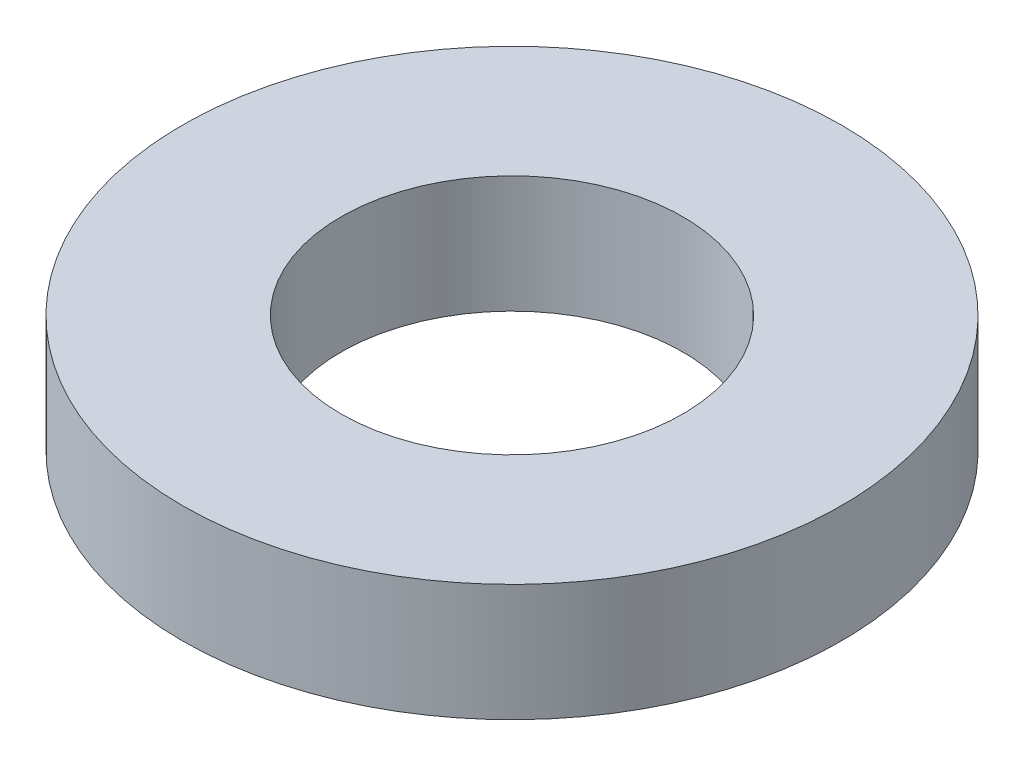
ISO-10303-21;
HEADER;
FILE_DESCRIPTION(('STEP AP214'),'2;1');
FILE_NAME('part.step','',(''),(''),'','','');
FILE_SCHEMA(('AUTOMOTIVE_DESIGN { 1 0 10303 214 1 1 1 1 }'));
ENDSEC;
DATA;
#1=APPLICATION_CONTEXT('core data for automotive mechanical design processes');
#2=APPLICATION_PROTOCOL_DEFINITION('international standard','automotive_design',2000,#1);
#3=PRODUCT_CONTEXT('',#1,'mechanical');
#4=PRODUCT('Part','Part','',(#3));
#5=PRODUCT_RELATED_PRODUCT_CATEGORY('part','',(#4));
#6=PRODUCT_DEFINITION_FORMATION('','',#4);
#7=PRODUCT_DEFINITION_CONTEXT('part definition',#1,'design');
#8=PRODUCT_DEFINITION('design','',#6,#7);
#9=PRODUCT_DEFINITION_SHAPE('','',#8);
#10=(LENGTH_UNIT() NAMED_UNIT(*) SI_UNIT(.MILLI.,.METRE.));
#11=(NAMED_UNIT(*) PLANE_ANGLE_UNIT() SI_UNIT($,.RADIAN.));
#12=(NAMED_UNIT(*) SI_UNIT($,.STERADIAN.) SOLID_ANGLE_UNIT());
#13=UNCERTAINTY_MEASURE_WITH_UNIT(LENGTH_MEASURE(1.E-05),#10,'distance_accuracy_value','');
#14=(GEOMETRIC_REPRESENTATION_CONTEXT(3) GLOBAL_UNCERTAINTY_ASSIGNED_CONTEXT((#13)) GLOBAL_UNIT_ASSIGNED_CONTEXT((#10,
#11,#12)) REPRESENTATION_CONTEXT('',''));
#15=CARTESIAN_POINT('',(0.,0.,0.));
#16=DIRECTION('',(0.,0.,1.));
#17=DIRECTION('',(1.,0.,0.));
#18=AXIS2_PLACEMENT_3D('',#15,#16,#17);
#19=CARTESIAN_POINT('',(0.,24.,0.));
#20=DIRECTION('',(0.,-1.,0.));
#21=DIRECTION('',(0.,0.,-1.));
#22=AXIS2_PLACEMENT_3D('',#19,#20,#21);
#23=CYLINDRICAL_SURFACE('',#22,67.5);
#24=CARTESIAN_POINT('',(0.,24.,0.));
#25=DIRECTION('',(0.,1.,0.));
#26=DIRECTION('',(0.,0.,1.));
#27=AXIS2_PLACEMENT_3D('',#24,#25,#26);
#28=CIRCLE('',#27,67.5);
#29=CARTESIAN_POINT('',(0.,24.,67.5));
#30=VERTEX_POINT('',#29);
#31=EDGE_CURVE('E10',#30,#30,#28,.T.);
#32=ORIENTED_EDGE('',*,*,#31,.F.);
#33=EDGE_LOOP('',(#32));
#34=FACE_BOUND('',#33,.T.);
#35=CARTESIAN_POINT('',(0.,0.,0.));
#36=DIRECTION('',(0.,1.,0.));
#37=DIRECTION('',(0.,0.,1.));
#38=AXIS2_PLACEMENT_3D('',#35,#36,#37);
#39=CIRCLE('',#38,67.5);
#40=CARTESIAN_POINT('',(0.,0.,67.5));
#41=VERTEX_POINT('',#40);
#42=EDGE_CURVE('E37',#41,#41,#39,.T.);
#43=ORIENTED_EDGE('',*,*,#42,.T.);
#44=EDGE_LOOP('',(#43));
#45=FACE_BOUND('',#44,.T.);
#46=ADVANCED_FACE('F40',(#34,#45),#23,.T.);
#47=CARTESIAN_POINT('',(0.,24.,0.));
#48=DIRECTION('',(0.,1.,0.));
#49=DIRECTION('',(0.,0.,1.));
#50=AXIS2_PLACEMENT_3D('',#47,#48,#49);
#51=PLANE('',#50);
#52=CARTESIAN_POINT('',(0.,24.,0.));
#53=DIRECTION('',(0.,1.,0.));
#54=DIRECTION('',(0.,0.,1.));
#55=AXIS2_PLACEMENT_3D('',#52,#53,#54);
#56=CIRCLE('',#55,35.);
#57=CARTESIAN_POINT('',(0.,24.,35.));
#58=VERTEX_POINT('',#57);
#59=EDGE_CURVE('E50',#58,#58,#56,.T.);
#60=ORIENTED_EDGE('',*,*,#59,.F.);
#61=EDGE_LOOP('',(#60));
#62=FACE_BOUND('',#61,.T.);
#63=ORIENTED_EDGE('',*,*,#31,.T.);
#64=EDGE_LOOP('',(#63));
#65=FACE_BOUND('',#64,.T.);
#66=ADVANCED_FACE('F59',(#62,#65),#51,.T.);
#67=CARTESIAN_POINT('',(0.,0.,0.));
#68=DIRECTION('',(0.,1.,0.));
#69=DIRECTION('',(0.,0.,1.));
#70=AXIS2_PLACEMENT_3D('',#67,#68,#69);
#71=PLANE('',#70);
#72=CARTESIAN_POINT('',(0.,0.,0.));
#73=DIRECTION('',(0.,1.,0.));
#74=DIRECTION('',(0.,0.,1.));
#75=AXIS2_PLACEMENT_3D('',#72,#73,#74);
#76=CIRCLE('',#75,35.);
#77=CARTESIAN_POINT('',(0.,0.,35.));
#78=VERTEX_POINT('',#77);
#79=EDGE_CURVE('E47',#78,#78,#76,.T.);
#80=ORIENTED_EDGE('',*,*,#79,.T.);
#81=EDGE_LOOP('',(#80));
#82=FACE_BOUND('',#81,.T.);
#83=ORIENTED_EDGE('',*,*,#42,.F.);
#84=EDGE_LOOP('',(#83));
#85=FACE_BOUND('',#84,.T.);
#86=ADVANCED_FACE('F58',(#82,#85),#71,.F.);
#87=CARTESIAN_POINT('',(0.,24.,0.));
#88=DIRECTION('',(0.,-1.,0.));
#89=DIRECTION('',(0.,0.,-1.));
#90=AXIS2_PLACEMENT_3D('',#87,#88,#89);
#91=CYLINDRICAL_SURFACE('',#90,35.);
#92=ORIENTED_EDGE('',*,*,#59,.T.);
#93=EDGE_LOOP('',(#92));
#94=FACE_BOUND('',#93,.T.);
#95=ORIENTED_EDGE('',*,*,#79,.F.);
#96=EDGE_LOOP('',(#95));
#97=FACE_BOUND('',#96,.T.);
#98=ADVANCED_FACE('F54',(#94,#97),#91,.F.);
#99=CLOSED_SHELL('',(#46,#66,#86,#98));
#100=MANIFOLD_SOLID_BREP('B2',#99);
#101=ADVANCED_BREP_SHAPE_REPRESENTATION('',(#18,#100),#14);
#102=SHAPE_DEFINITION_REPRESENTATION(#9,#101);
ENDSEC;
END-ISO-10303-21;
